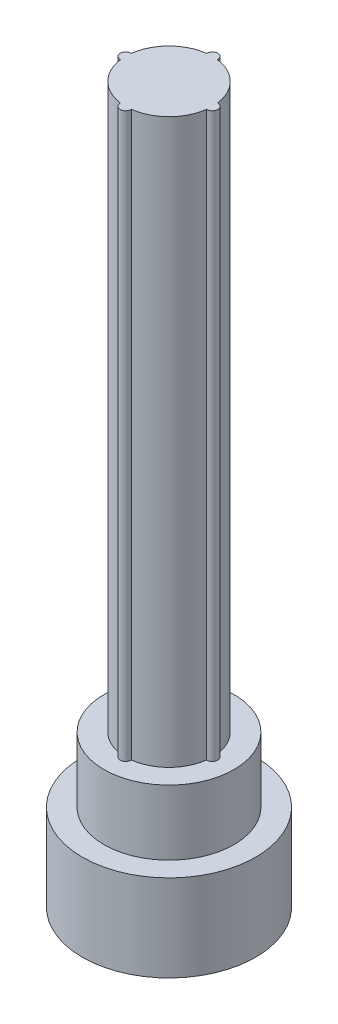
ISO-10303-21;
HEADER;
FILE_DESCRIPTION(('STEP AP214'),'2;1');
FILE_NAME('part.step','',(''),(''),'','','');
FILE_SCHEMA(('AUTOMOTIVE_DESIGN { 1 0 10303 214 1 1 1 1 }'));
ENDSEC;
DATA;
#1=APPLICATION_CONTEXT('core data for automotive mechanical design processes');
#2=APPLICATION_PROTOCOL_DEFINITION('international standard','automotive_design',2000,#1);
#3=PRODUCT_CONTEXT('',#1,'mechanical');
#4=PRODUCT('Part','Part','',(#3));
#5=PRODUCT_RELATED_PRODUCT_CATEGORY('part','',(#4));
#6=PRODUCT_DEFINITION_FORMATION('','',#4);
#7=PRODUCT_DEFINITION_CONTEXT('part definition',#1,'design');
#8=PRODUCT_DEFINITION('design','',#6,#7);
#9=PRODUCT_DEFINITION_SHAPE('','',#8);
#10=(LENGTH_UNIT() NAMED_UNIT(*) SI_UNIT(.MILLI.,.METRE.));
#11=(NAMED_UNIT(*) PLANE_ANGLE_UNIT() SI_UNIT($,.RADIAN.));
#12=(NAMED_UNIT(*) SI_UNIT($,.STERADIAN.) SOLID_ANGLE_UNIT());
#13=UNCERTAINTY_MEASURE_WITH_UNIT(LENGTH_MEASURE(1.E-05),#10,'distance_accuracy_value','');
#14=(GEOMETRIC_REPRESENTATION_CONTEXT(3) GLOBAL_UNCERTAINTY_ASSIGNED_CONTEXT((#13)) GLOBAL_UNIT_ASSIGNED_CONTEXT((#10,
#11,#12)) REPRESENTATION_CONTEXT('',''));
#15=CARTESIAN_POINT('',(0.,0.,0.));
#16=DIRECTION('',(0.,0.,1.));
#17=DIRECTION('',(1.,0.,0.));
#18=AXIS2_PLACEMENT_3D('',#15,#16,#17);
#19=CARTESIAN_POINT('',(0.,16.5,0.));
#20=DIRECTION('',(0.,-1.,0.));
#21=DIRECTION('',(0.,0.,-1.));
#22=AXIS2_PLACEMENT_3D('',#19,#20,#21);
#23=CYLINDRICAL_SURFACE('',#22,1.);
#24=CARTESIAN_POINT('',(0.,3.5,0.));
#25=DIRECTION('',(0.,1.,0.));
#26=DIRECTION('',(0.,0.,1.));
#27=AXIS2_PLACEMENT_3D('',#24,#25,#26);
#28=CIRCLE('',#27,1.);
#29=CARTESIAN_POINT('',(0.12475562048962,3.5,0.9921875));
#30=VERTEX_POINT('',#29);
#31=CARTESIAN_POINT('',(0.9921875,3.5,0.12475562048962));
#32=VERTEX_POINT('',#31);
#33=EDGE_CURVE('E112',#30,#32,#28,.T.);
#34=ORIENTED_EDGE('',*,*,#33,.T.);
#35=DIRECTION('',(0.,1.,0.));
#36=VECTOR('',#35,1.);
#37=CARTESIAN_POINT('',(0.9921875,10.,0.12475562048962));
#38=LINE('',#37,#36);
#39=CARTESIAN_POINT('',(0.9921875,16.5,0.12475562048962));
#40=VERTEX_POINT('',#39);
#41=EDGE_CURVE('E96',#32,#40,#38,.T.);
#42=ORIENTED_EDGE('',*,*,#41,.T.);
#43=CARTESIAN_POINT('',(0.,16.5,0.));
#44=DIRECTION('',(0.,1.,0.));
#45=DIRECTION('',(0.,0.,1.));
#46=AXIS2_PLACEMENT_3D('',#43,#44,#45);
#47=CIRCLE('',#46,1.);
#48=CARTESIAN_POINT('',(0.124755620489619,16.5,0.9921875));
#49=VERTEX_POINT('',#48);
#50=EDGE_CURVE('E139',#49,#40,#47,.T.);
#51=ORIENTED_EDGE('',*,*,#50,.F.);
#52=DIRECTION('',(0.,1.,0.));
#53=VECTOR('',#52,1.);
#54=CARTESIAN_POINT('',(0.12475562048962,10.,0.9921875));
#55=LINE('',#54,#53);
#56=EDGE_CURVE('E117',#49,#30,#55,.F.);
#57=ORIENTED_EDGE('',*,*,#56,.T.);
#58=EDGE_LOOP('',(#34,#42,#51,#57));
#59=FACE_BOUND('',#58,.T.);
#60=ADVANCED_FACE('F33',(#59),#23,.T.);
#61=CARTESIAN_POINT('',(-0.9921875,3.5,0.12475562048962));
#62=VERTEX_POINT('',#61);
#63=CARTESIAN_POINT('',(-0.12475562048962,3.5,0.9921875));
#64=VERTEX_POINT('',#63);
#65=EDGE_CURVE('E118',#62,#64,#28,.T.);
#66=ORIENTED_EDGE('',*,*,#65,.T.);
#67=DIRECTION('',(0.,1.,0.));
#68=VECTOR('',#67,1.);
#69=CARTESIAN_POINT('',(-0.12475562048962,10.,0.9921875));
#70=LINE('',#69,#68);
#71=CARTESIAN_POINT('',(-0.12475562048962,16.5,0.9921875));
#72=VERTEX_POINT('',#71);
#73=EDGE_CURVE('E210',#64,#72,#70,.T.);
#74=ORIENTED_EDGE('',*,*,#73,.T.);
#75=CARTESIAN_POINT('',(-0.9921875,16.5,0.124755620489619));
#76=VERTEX_POINT('',#75);
#77=EDGE_CURVE('E137',#76,#72,#47,.T.);
#78=ORIENTED_EDGE('',*,*,#77,.F.);
#79=DIRECTION('',(0.,1.,0.));
#80=VECTOR('',#79,1.);
#81=CARTESIAN_POINT('',(-0.9921875,10.,0.12475562048962));
#82=LINE('',#81,#80);
#83=EDGE_CURVE('E206',#76,#62,#82,.F.);
#84=ORIENTED_EDGE('',*,*,#83,.T.);
#85=EDGE_LOOP('',(#66,#74,#78,#84));
#86=FACE_BOUND('',#85,.T.);
#87=ADVANCED_FACE('F159',(#86),#23,.T.);
#88=CARTESIAN_POINT('',(-0.12475562048962,3.5,-0.9921875));
#89=VERTEX_POINT('',#88);
#90=CARTESIAN_POINT('',(-0.9921875,3.5,-0.12475562048962));
#91=VERTEX_POINT('',#90);
#92=EDGE_CURVE('E121',#89,#91,#28,.T.);
#93=ORIENTED_EDGE('',*,*,#92,.T.);
#94=DIRECTION('',(0.,1.,0.));
#95=VECTOR('',#94,1.);
#96=CARTESIAN_POINT('',(-0.9921875,10.,-0.12475562048962));
#97=LINE('',#96,#95);
#98=CARTESIAN_POINT('',(-0.9921875,16.5,-0.12475562048962));
#99=VERTEX_POINT('',#98);
#100=EDGE_CURVE('E196',#91,#99,#97,.T.);
#101=ORIENTED_EDGE('',*,*,#100,.T.);
#102=CARTESIAN_POINT('',(-0.124755620489619,16.5,-0.9921875));
#103=VERTEX_POINT('',#102);
#104=EDGE_CURVE('E127',#103,#99,#47,.T.);
#105=ORIENTED_EDGE('',*,*,#104,.F.);
#106=DIRECTION('',(0.,1.,0.));
#107=VECTOR('',#106,1.);
#108=CARTESIAN_POINT('',(-0.12475562048962,10.,-0.9921875));
#109=LINE('',#108,#107);
#110=EDGE_CURVE('E198',#103,#89,#109,.F.);
#111=ORIENTED_EDGE('',*,*,#110,.T.);
#112=EDGE_LOOP('',(#93,#101,#105,#111));
#113=FACE_BOUND('',#112,.T.);
#114=ADVANCED_FACE('F157',(#113),#23,.T.);
#115=CARTESIAN_POINT('',(0.,2.,0.));
#116=DIRECTION('',(0.,-1.,0.));
#117=DIRECTION('',(0.,0.,-1.));
#118=AXIS2_PLACEMENT_3D('',#115,#116,#117);
#119=CYLINDRICAL_SURFACE('',#118,2.);
#120=CARTESIAN_POINT('',(0.,2.,0.));
#121=DIRECTION('',(0.,1.,0.));
#122=DIRECTION('',(0.,0.,1.));
#123=AXIS2_PLACEMENT_3D('',#120,#121,#122);
#124=CIRCLE('',#123,2.);
#125=CARTESIAN_POINT('',(0.,2.,2.));
#126=VERTEX_POINT('',#125);
#127=EDGE_CURVE('E11',#126,#126,#124,.T.);
#128=ORIENTED_EDGE('',*,*,#127,.F.);
#129=EDGE_LOOP('',(#128));
#130=FACE_BOUND('',#129,.T.);
#131=CARTESIAN_POINT('',(0.,0.,0.));
#132=DIRECTION('',(0.,1.,0.));
#133=DIRECTION('',(0.,0.,1.));
#134=AXIS2_PLACEMENT_3D('',#131,#132,#133);
#135=CIRCLE('',#134,2.);
#136=CARTESIAN_POINT('',(0.,0.,2.));
#137=VERTEX_POINT('',#136);
#138=EDGE_CURVE('E37',#137,#137,#135,.T.);
#139=ORIENTED_EDGE('',*,*,#138,.T.);
#140=EDGE_LOOP('',(#139));
#141=FACE_BOUND('',#140,.T.);
#142=ADVANCED_FACE('F35',(#130,#141),#119,.T.);
#143=CARTESIAN_POINT('',(0.,2.,0.));
#144=DIRECTION('',(0.,1.,0.));
#145=DIRECTION('',(0.,0.,1.));
#146=AXIS2_PLACEMENT_3D('',#143,#144,#145);
#147=PLANE('',#146);
#148=CARTESIAN_POINT('',(0.,2.,0.));
#149=DIRECTION('',(0.,1.,0.));
#150=DIRECTION('',(0.,0.,1.));
#151=AXIS2_PLACEMENT_3D('',#148,#149,#150);
#152=CIRCLE('',#151,1.5);
#153=CARTESIAN_POINT('',(0.,2.,1.5));
#154=VERTEX_POINT('',#153);
#155=EDGE_CURVE('E132',#154,#154,#152,.T.);
#156=ORIENTED_EDGE('',*,*,#155,.F.);
#157=EDGE_LOOP('',(#156));
#158=FACE_BOUND('',#157,.T.);
#159=ORIENTED_EDGE('',*,*,#127,.T.);
#160=EDGE_LOOP('',(#159));
#161=FACE_BOUND('',#160,.T.);
#162=ADVANCED_FACE('F173',(#158,#161),#147,.T.);
#163=CARTESIAN_POINT('',(0.,0.,0.));
#164=DIRECTION('',(0.,1.,0.));
#165=DIRECTION('',(0.,0.,1.));
#166=AXIS2_PLACEMENT_3D('',#163,#164,#165);
#167=PLANE('',#166);
#168=ORIENTED_EDGE('',*,*,#138,.F.);
#169=EDGE_LOOP('',(#168));
#170=FACE_BOUND('',#169,.T.);
#171=ADVANCED_FACE('F171',(#170),#167,.F.);
#172=CARTESIAN_POINT('',(0.,3.5,0.));
#173=DIRECTION('',(0.,-1.,0.));
#174=DIRECTION('',(0.,0.,-1.));
#175=AXIS2_PLACEMENT_3D('',#172,#173,#174);
#176=CYLINDRICAL_SURFACE('',#175,1.5);
#177=CARTESIAN_POINT('',(0.,3.5,0.));
#178=DIRECTION('',(0.,1.,0.));
#179=DIRECTION('',(0.,0.,1.));
#180=AXIS2_PLACEMENT_3D('',#177,#178,#179);
#181=CIRCLE('',#180,1.5);
#182=CARTESIAN_POINT('',(0.,3.5,1.5));
#183=VERTEX_POINT('',#182);
#184=EDGE_CURVE('E129',#183,#183,#181,.T.);
#185=ORIENTED_EDGE('',*,*,#184,.F.);
#186=EDGE_LOOP('',(#185));
#187=FACE_BOUND('',#186,.T.);
#188=ORIENTED_EDGE('',*,*,#155,.T.);
#189=EDGE_LOOP('',(#188));
#190=FACE_BOUND('',#189,.T.);
#191=ADVANCED_FACE('F168',(#187,#190),#176,.T.);
#192=CARTESIAN_POINT('',(0.,3.5,0.));
#193=DIRECTION('',(0.,1.,0.));
#194=DIRECTION('',(0.,0.,1.));
#195=AXIS2_PLACEMENT_3D('',#192,#193,#194);
#196=PLANE('',#195);
#197=CARTESIAN_POINT('',(1.,3.5,0.));
#198=DIRECTION('',(0.,1.,0.));
#199=DIRECTION('',(0.,0.,1.));
#200=AXIS2_PLACEMENT_3D('',#197,#198,#199);
#201=CIRCLE('',#200,0.125);
#202=CARTESIAN_POINT('',(0.9921875,3.5,-0.12475562048962));
#203=VERTEX_POINT('',#202);
#204=EDGE_CURVE('E99',#203,#32,#201,.F.);
#205=ORIENTED_EDGE('',*,*,#204,.T.);
#206=ORIENTED_EDGE('',*,*,#33,.F.);
#207=CARTESIAN_POINT('',(0.,3.5,1.));
#208=DIRECTION('',(0.,1.,0.));
#209=DIRECTION('',(0.,0.,1.));
#210=AXIS2_PLACEMENT_3D('',#207,#208,#209);
#211=CIRCLE('',#210,0.125);
#212=EDGE_CURVE('E224',#30,#64,#211,.F.);
#213=ORIENTED_EDGE('',*,*,#212,.T.);
#214=ORIENTED_EDGE('',*,*,#65,.F.);
#215=CARTESIAN_POINT('',(-1.,3.5,0.));
#216=DIRECTION('',(0.,1.,0.));
#217=DIRECTION('',(0.,0.,1.));
#218=AXIS2_PLACEMENT_3D('',#215,#216,#217);
#219=CIRCLE('',#218,0.125);
#220=EDGE_CURVE('E202',#62,#91,#219,.F.);
#221=ORIENTED_EDGE('',*,*,#220,.T.);
#222=ORIENTED_EDGE('',*,*,#92,.F.);
#223=CARTESIAN_POINT('',(0.,3.5,-1.));
#224=DIRECTION('',(0.,1.,0.));
#225=DIRECTION('',(0.,0.,1.));
#226=AXIS2_PLACEMENT_3D('',#223,#224,#225);
#227=CIRCLE('',#226,0.125);
#228=CARTESIAN_POINT('',(0.12475562048962,3.5,-0.9921875));
#229=VERTEX_POINT('',#228);
#230=EDGE_CURVE('E200',#89,#229,#227,.F.);
#231=ORIENTED_EDGE('',*,*,#230,.T.);
#232=EDGE_CURVE('E114',#203,#229,#28,.T.);
#233=ORIENTED_EDGE('',*,*,#232,.F.);
#234=EDGE_LOOP('',(#205,#206,#213,#214,#221,#222,#231,#233));
#235=FACE_BOUND('',#234,.T.);
#236=ORIENTED_EDGE('',*,*,#184,.T.);
#237=EDGE_LOOP('',(#236));
#238=FACE_BOUND('',#237,.T.);
#239=ADVANCED_FACE('F109',(#235,#238),#196,.T.);
#240=CARTESIAN_POINT('',(0.9921875,16.5,-0.124755620489619));
#241=VERTEX_POINT('',#240);
#242=CARTESIAN_POINT('',(0.12475562048962,16.5,-0.9921875));
#243=VERTEX_POINT('',#242);
#244=EDGE_CURVE('E126',#241,#243,#47,.T.);
#245=ORIENTED_EDGE('',*,*,#244,.F.);
#246=DIRECTION('',(0.,1.,0.));
#247=VECTOR('',#246,1.);
#248=CARTESIAN_POINT('',(0.9921875,10.,-0.12475562048962));
#249=LINE('',#248,#247);
#250=EDGE_CURVE('E104',#241,#203,#249,.F.);
#251=ORIENTED_EDGE('',*,*,#250,.T.);
#252=ORIENTED_EDGE('',*,*,#232,.T.);
#253=DIRECTION('',(0.,1.,0.));
#254=VECTOR('',#253,1.);
#255=CARTESIAN_POINT('',(0.12475562048962,10.,-0.9921875));
#256=LINE('',#255,#254);
#257=EDGE_CURVE('E122',#229,#243,#256,.T.);
#258=ORIENTED_EDGE('',*,*,#257,.T.);
#259=EDGE_LOOP('',(#245,#251,#252,#258));
#260=FACE_BOUND('',#259,.T.);
#261=ADVANCED_FACE('F145',(#260),#23,.T.);
#262=CARTESIAN_POINT('',(0.,16.5,0.));
#263=DIRECTION('',(0.,1.,0.));
#264=DIRECTION('',(0.,0.,1.));
#265=AXIS2_PLACEMENT_3D('',#262,#263,#264);
#266=PLANE('',#265);
#267=ORIENTED_EDGE('',*,*,#50,.T.);
#268=CARTESIAN_POINT('',(1.,16.5,0.));
#269=DIRECTION('',(0.,1.,0.));
#270=DIRECTION('',(0.,0.,1.));
#271=AXIS2_PLACEMENT_3D('',#268,#269,#270);
#272=CIRCLE('',#271,0.125);
#273=EDGE_CURVE('E48',#40,#241,#272,.T.);
#274=ORIENTED_EDGE('',*,*,#273,.T.);
#275=ORIENTED_EDGE('',*,*,#244,.T.);
#276=CARTESIAN_POINT('',(0.,16.5,-1.));
#277=DIRECTION('',(0.,1.,0.));
#278=DIRECTION('',(0.,0.,1.));
#279=AXIS2_PLACEMENT_3D('',#276,#277,#278);
#280=CIRCLE('',#279,0.125);
#281=EDGE_CURVE('E215',#243,#103,#280,.T.);
#282=ORIENTED_EDGE('',*,*,#281,.T.);
#283=ORIENTED_EDGE('',*,*,#104,.T.);
#284=CARTESIAN_POINT('',(-1.,16.5,0.));
#285=DIRECTION('',(0.,1.,0.));
#286=DIRECTION('',(0.,0.,1.));
#287=AXIS2_PLACEMENT_3D('',#284,#285,#286);
#288=CIRCLE('',#287,0.125);
#289=EDGE_CURVE('E207',#99,#76,#288,.T.);
#290=ORIENTED_EDGE('',*,*,#289,.T.);
#291=ORIENTED_EDGE('',*,*,#77,.T.);
#292=CARTESIAN_POINT('',(0.,16.5,1.));
#293=DIRECTION('',(0.,1.,0.));
#294=DIRECTION('',(0.,0.,1.));
#295=AXIS2_PLACEMENT_3D('',#292,#293,#294);
#296=CIRCLE('',#295,0.125);
#297=EDGE_CURVE('E54',#72,#49,#296,.T.);
#298=ORIENTED_EDGE('',*,*,#297,.T.);
#299=EDGE_LOOP('',(#267,#274,#275,#282,#283,#290,#291,#298));
#300=FACE_BOUND('',#299,.T.);
#301=ADVANCED_FACE('F142',(#300),#266,.T.);
#302=CARTESIAN_POINT('',(0.,3.14644660940672,-1.));
#303=DIRECTION('',(0.,1.,0.));
#304=DIRECTION('',(0.,0.,1.));
#305=AXIS2_PLACEMENT_3D('',#302,#303,#304);
#306=CYLINDRICAL_SURFACE('',#305,0.125);
#307=ORIENTED_EDGE('',*,*,#257,.F.);
#308=ORIENTED_EDGE('',*,*,#230,.F.);
#309=ORIENTED_EDGE('',*,*,#110,.F.);
#310=ORIENTED_EDGE('',*,*,#281,.F.);
#311=EDGE_LOOP('',(#307,#308,#309,#310));
#312=FACE_BOUND('',#311,.T.);
#313=ADVANCED_FACE('F144',(#312),#306,.T.);
#314=CARTESIAN_POINT('',(-1.,3.14644660940672,0.));
#315=DIRECTION('',(0.,1.,0.));
#316=DIRECTION('',(0.,0.,1.));
#317=AXIS2_PLACEMENT_3D('',#314,#315,#316);
#318=CYLINDRICAL_SURFACE('',#317,0.125);
#319=ORIENTED_EDGE('',*,*,#100,.F.);
#320=ORIENTED_EDGE('',*,*,#220,.F.);
#321=ORIENTED_EDGE('',*,*,#83,.F.);
#322=ORIENTED_EDGE('',*,*,#289,.F.);
#323=EDGE_LOOP('',(#319,#320,#321,#322));
#324=FACE_BOUND('',#323,.T.);
#325=ADVANCED_FACE('F151',(#324),#318,.T.);
#326=CARTESIAN_POINT('',(0.,3.14644660940672,1.));
#327=DIRECTION('',(0.,1.,0.));
#328=DIRECTION('',(0.,0.,1.));
#329=AXIS2_PLACEMENT_3D('',#326,#327,#328);
#330=CYLINDRICAL_SURFACE('',#329,0.125);
#331=ORIENTED_EDGE('',*,*,#73,.F.);
#332=ORIENTED_EDGE('',*,*,#212,.F.);
#333=ORIENTED_EDGE('',*,*,#56,.F.);
#334=ORIENTED_EDGE('',*,*,#297,.F.);
#335=EDGE_LOOP('',(#331,#332,#333,#334));
#336=FACE_BOUND('',#335,.T.);
#337=ADVANCED_FACE('F230',(#336),#330,.T.);
#338=CARTESIAN_POINT('',(1.,3.14644660940672,0.));
#339=DIRECTION('',(0.,1.,0.));
#340=DIRECTION('',(0.,0.,1.));
#341=AXIS2_PLACEMENT_3D('',#338,#339,#340);
#342=CYLINDRICAL_SURFACE('',#341,0.125);
#343=ORIENTED_EDGE('',*,*,#41,.F.);
#344=ORIENTED_EDGE('',*,*,#204,.F.);
#345=ORIENTED_EDGE('',*,*,#250,.F.);
#346=ORIENTED_EDGE('',*,*,#273,.F.);
#347=EDGE_LOOP('',(#343,#344,#345,#346));
#348=FACE_BOUND('',#347,.T.);
#349=ADVANCED_FACE('F98',(#348),#342,.T.);
#350=CLOSED_SHELL('',(#60,#87,#114,#142,#162,#171,#191,#239,#261,#301,#313,#325,#337,#349));
#351=MANIFOLD_SOLID_BREP('B2',#350);
#352=ADVANCED_BREP_SHAPE_REPRESENTATION('',(#18,#351),#14);
#353=SHAPE_DEFINITION_REPRESENTATION(#9,#352);
ENDSEC;
END-ISO-10303-21;
